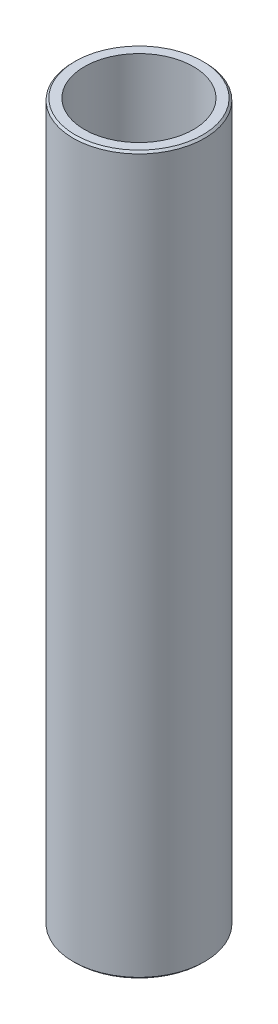
ISO-10303-21;
HEADER;
FILE_DESCRIPTION(('STEP AP214'),'2;1');
FILE_NAME('part.step','',(''),(''),'','','');
FILE_SCHEMA(('AUTOMOTIVE_DESIGN { 1 0 10303 214 1 1 1 1 }'));
ENDSEC;
DATA;
#1=APPLICATION_CONTEXT('core data for automotive mechanical design processes');
#2=APPLICATION_PROTOCOL_DEFINITION('international standard','automotive_design',2000,#1);
#3=PRODUCT_CONTEXT('',#1,'mechanical');
#4=PRODUCT('Part','Part','',(#3));
#5=PRODUCT_RELATED_PRODUCT_CATEGORY('part','',(#4));
#6=PRODUCT_DEFINITION_FORMATION('','',#4);
#7=PRODUCT_DEFINITION_CONTEXT('part definition',#1,'design');
#8=PRODUCT_DEFINITION('design','',#6,#7);
#9=PRODUCT_DEFINITION_SHAPE('','',#8);
#10=(LENGTH_UNIT() NAMED_UNIT(*) SI_UNIT(.MILLI.,.METRE.));
#11=(NAMED_UNIT(*) PLANE_ANGLE_UNIT() SI_UNIT($,.RADIAN.));
#12=(NAMED_UNIT(*) SI_UNIT($,.STERADIAN.) SOLID_ANGLE_UNIT());
#13=UNCERTAINTY_MEASURE_WITH_UNIT(LENGTH_MEASURE(1.E-05),#10,'distance_accuracy_value','');
#14=(GEOMETRIC_REPRESENTATION_CONTEXT(3) GLOBAL_UNCERTAINTY_ASSIGNED_CONTEXT((#13)) GLOBAL_UNIT_ASSIGNED_CONTEXT((#10,
#11,#12)) REPRESENTATION_CONTEXT('',''));
#15=CARTESIAN_POINT('',(0.,0.,0.));
#16=DIRECTION('',(0.,0.,1.));
#17=DIRECTION('',(1.,0.,0.));
#18=AXIS2_PLACEMENT_3D('',#15,#16,#17);
#19=CARTESIAN_POINT('',(0.,600.,0.));
#20=DIRECTION('',(0.,-1.,0.));
#21=DIRECTION('',(0.,0.,-1.));
#22=AXIS2_PLACEMENT_3D('',#19,#20,#21);
#23=CYLINDRICAL_SURFACE('',#22,55.);
#24=CARTESIAN_POINT('',(0.,598.366509316672,0.));
#25=DIRECTION('',(0.,1.,0.));
#26=DIRECTION('',(0.,0.,1.));
#27=AXIS2_PLACEMENT_3D('',#24,#25,#26);
#28=CIRCLE('',#27,55.);
#29=CARTESIAN_POINT('',(0.,598.366509316672,55.));
#30=VERTEX_POINT('',#29);
#31=EDGE_CURVE('E50',#30,#30,#28,.F.);
#32=ORIENTED_EDGE('',*,*,#31,.T.);
#33=EDGE_LOOP('',(#32));
#34=FACE_BOUND('',#33,.T.);
#35=CARTESIAN_POINT('',(0.,1.63349068332819,0.));
#36=DIRECTION('',(0.,1.,0.));
#37=DIRECTION('',(0.,0.,1.));
#38=AXIS2_PLACEMENT_3D('',#35,#36,#37);
#39=CIRCLE('',#38,55.);
#40=CARTESIAN_POINT('',(0.,1.63349068332819,55.));
#41=VERTEX_POINT('',#40);
#42=EDGE_CURVE('E51',#41,#41,#39,.T.);
#43=ORIENTED_EDGE('',*,*,#42,.T.);
#44=EDGE_LOOP('',(#43));
#45=FACE_BOUND('',#44,.T.);
#46=ADVANCED_FACE('F39',(#34,#45),#23,.T.);
#47=CARTESIAN_POINT('',(0.,600.,0.));
#48=DIRECTION('',(0.,1.,0.));
#49=DIRECTION('',(0.,0.,1.));
#50=AXIS2_PLACEMENT_3D('',#47,#48,#49);
#51=PLANE('',#50);
#52=CARTESIAN_POINT('',(0.,600.,0.));
#53=DIRECTION('',(0.,1.,0.));
#54=DIRECTION('',(0.,0.,1.));
#55=AXIS2_PLACEMENT_3D('',#52,#53,#54);
#56=CIRCLE('',#55,53.3665093166719);
#57=CARTESIAN_POINT('',(0.,600.,53.3665093166719));
#58=VERTEX_POINT('',#57);
#59=EDGE_CURVE('E54',#58,#58,#56,.T.);
#60=ORIENTED_EDGE('',*,*,#59,.T.);
#61=EDGE_LOOP('',(#60));
#62=FACE_BOUND('',#61,.T.);
#63=CARTESIAN_POINT('',(0.,600.,0.));
#64=DIRECTION('',(0.,1.,0.));
#65=DIRECTION('',(0.,0.,1.));
#66=AXIS2_PLACEMENT_3D('',#63,#64,#65);
#67=CIRCLE('',#66,45.6349334912808);
#68=CARTESIAN_POINT('',(0.,600.,45.6349334912808));
#69=VERTEX_POINT('',#68);
#70=EDGE_CURVE('E58',#69,#69,#67,.T.);
#71=ORIENTED_EDGE('',*,*,#70,.F.);
#72=EDGE_LOOP('',(#71));
#73=FACE_BOUND('',#72,.T.);
#74=ADVANCED_FACE('F69',(#62,#73),#51,.T.);
#75=CARTESIAN_POINT('',(0.,0.,0.));
#76=DIRECTION('',(0.,1.,0.));
#77=DIRECTION('',(0.,0.,1.));
#78=AXIS2_PLACEMENT_3D('',#75,#76,#77);
#79=PLANE('',#78);
#80=CARTESIAN_POINT('',(0.,0.,0.));
#81=DIRECTION('',(0.,1.,0.));
#82=DIRECTION('',(0.,0.,1.));
#83=AXIS2_PLACEMENT_3D('',#80,#81,#82);
#84=CIRCLE('',#83,53.3665093166718);
#85=CARTESIAN_POINT('',(0.,0.,53.3665093166718));
#86=VERTEX_POINT('',#85);
#87=EDGE_CURVE('E10',#86,#86,#84,.F.);
#88=ORIENTED_EDGE('',*,*,#87,.T.);
#89=EDGE_LOOP('',(#88));
#90=FACE_BOUND('',#89,.T.);
#91=CARTESIAN_POINT('',(0.,0.,0.));
#92=DIRECTION('',(0.,1.,0.));
#93=DIRECTION('',(0.,0.,1.));
#94=AXIS2_PLACEMENT_3D('',#91,#92,#93);
#95=CIRCLE('',#94,45.6349334912808);
#96=CARTESIAN_POINT('',(0.,0.,45.6349334912808));
#97=VERTEX_POINT('',#96);
#98=EDGE_CURVE('E63',#97,#97,#95,.T.);
#99=ORIENTED_EDGE('',*,*,#98,.T.);
#100=EDGE_LOOP('',(#99));
#101=FACE_BOUND('',#100,.T.);
#102=ADVANCED_FACE('F75',(#90,#101),#79,.F.);
#103=CARTESIAN_POINT('',(0.,600.,0.));
#104=DIRECTION('',(0.,-1.,0.));
#105=DIRECTION('',(0.,0.,-1.));
#106=AXIS2_PLACEMENT_3D('',#103,#104,#105);
#107=CYLINDRICAL_SURFACE('',#106,45.6349334912808);
#108=ORIENTED_EDGE('',*,*,#70,.T.);
#109=EDGE_LOOP('',(#108));
#110=FACE_BOUND('',#109,.T.);
#111=ORIENTED_EDGE('',*,*,#98,.F.);
#112=EDGE_LOOP('',(#111));
#113=FACE_BOUND('',#112,.T.);
#114=ADVANCED_FACE('F70',(#110,#113),#107,.F.);
#115=CARTESIAN_POINT('',(0.,600.,0.));
#116=DIRECTION('',(0.,-1.,0.));
#117=DIRECTION('',(0.,0.,-1.));
#118=AXIS2_PLACEMENT_3D('',#115,#116,#117);
#119=CONICAL_SURFACE('',#118,53.3665093166719,0.785398163397467);
#120=ORIENTED_EDGE('',*,*,#31,.F.);
#121=EDGE_LOOP('',(#120));
#122=FACE_BOUND('',#121,.T.);
#123=ORIENTED_EDGE('',*,*,#59,.F.);
#124=EDGE_LOOP('',(#123));
#125=FACE_BOUND('',#124,.T.);
#126=ADVANCED_FACE('F81',(#122,#125),#119,.T.);
#127=CARTESIAN_POINT('',(0.,1.63349068332819,0.));
#128=DIRECTION('',(0.,1.,0.));
#129=DIRECTION('',(0.,0.,1.));
#130=AXIS2_PLACEMENT_3D('',#127,#128,#129);
#131=CONICAL_SURFACE('',#130,55.,0.785398163397467);
#132=ORIENTED_EDGE('',*,*,#87,.F.);
#133=EDGE_LOOP('',(#132));
#134=FACE_BOUND('',#133,.T.);
#135=ORIENTED_EDGE('',*,*,#42,.F.);
#136=EDGE_LOOP('',(#135));
#137=FACE_BOUND('',#136,.T.);
#138=ADVANCED_FACE('F45',(#134,#137),#131,.T.);
#139=CLOSED_SHELL('',(#46,#74,#102,#114,#126,#138));
#140=MANIFOLD_SOLID_BREP('B2',#139);
#141=ADVANCED_BREP_SHAPE_REPRESENTATION('',(#18,#140),#14);
#142=SHAPE_DEFINITION_REPRESENTATION(#9,#141);
ENDSEC;
END-ISO-10303-21;
